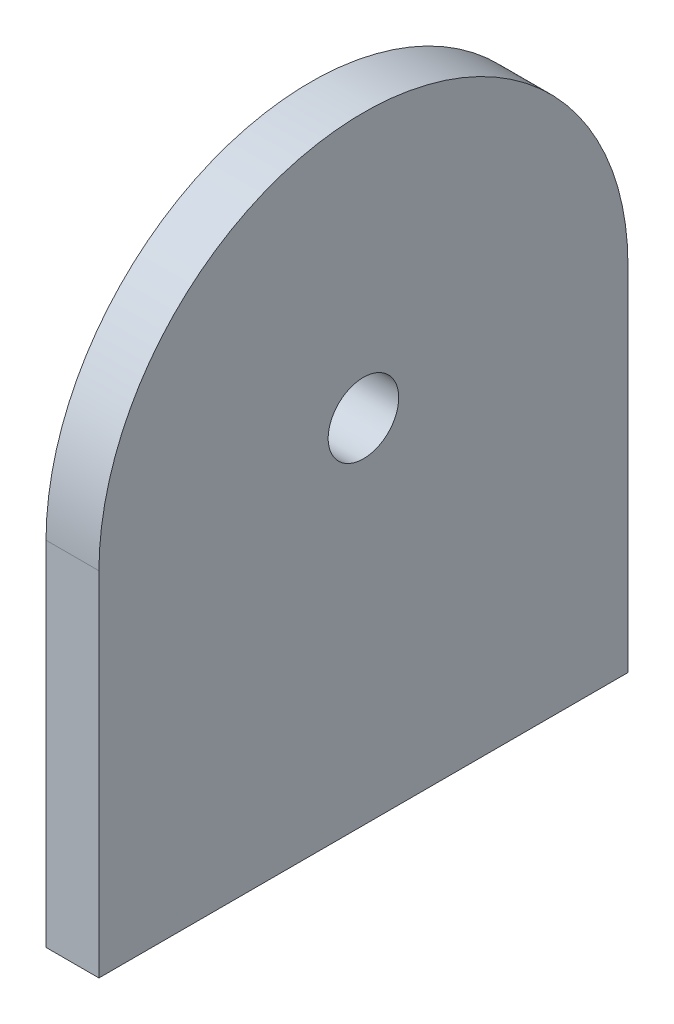
ISO-10303-21;
HEADER;
FILE_DESCRIPTION(('STEP AP214'),'2;1');
FILE_NAME('part.step','',(''),(''),'','','');
FILE_SCHEMA(('AUTOMOTIVE_DESIGN { 1 0 10303 214 1 1 1 1 }'));
ENDSEC;
DATA;
#1=APPLICATION_CONTEXT('core data for automotive mechanical design processes');
#2=APPLICATION_PROTOCOL_DEFINITION('international standard','automotive_design',2000,#1);
#3=PRODUCT_CONTEXT('',#1,'mechanical');
#4=PRODUCT('Part','Part','',(#3));
#5=PRODUCT_RELATED_PRODUCT_CATEGORY('part','',(#4));
#6=PRODUCT_DEFINITION_FORMATION('','',#4);
#7=PRODUCT_DEFINITION_CONTEXT('part definition',#1,'design');
#8=PRODUCT_DEFINITION('design','',#6,#7);
#9=PRODUCT_DEFINITION_SHAPE('','',#8);
#10=(LENGTH_UNIT() NAMED_UNIT(*) SI_UNIT(.MILLI.,.METRE.));
#11=(NAMED_UNIT(*) PLANE_ANGLE_UNIT() SI_UNIT($,.RADIAN.));
#12=(NAMED_UNIT(*) SI_UNIT($,.STERADIAN.) SOLID_ANGLE_UNIT());
#13=UNCERTAINTY_MEASURE_WITH_UNIT(LENGTH_MEASURE(1.E-05),#10,'distance_accuracy_value','');
#14=(GEOMETRIC_REPRESENTATION_CONTEXT(3) GLOBAL_UNCERTAINTY_ASSIGNED_CONTEXT((#13)) GLOBAL_UNIT_ASSIGNED_CONTEXT((#10,
#11,#12)) REPRESENTATION_CONTEXT('',''));
#15=CARTESIAN_POINT('',(0.,0.,0.));
#16=DIRECTION('',(0.,0.,1.));
#17=DIRECTION('',(1.,0.,0.));
#18=AXIS2_PLACEMENT_3D('',#15,#16,#17);
#19=CARTESIAN_POINT('',(3.,20.,15.0000000000001));
#20=DIRECTION('',(1.,0.,0.));
#21=DIRECTION('',(0.,0.,-1.));
#22=AXIS2_PLACEMENT_3D('',#19,#20,#21);
#23=PLANE('',#22);
#24=CARTESIAN_POINT('',(3.,20.,15.0000000000001));
#25=DIRECTION('',(1.,0.,0.));
#26=DIRECTION('',(0.,0.,-1.));
#27=AXIS2_PLACEMENT_3D('',#24,#25,#26);
#28=CIRCLE('',#27,15.);
#29=CARTESIAN_POINT('',(3.,20.,0.));
#30=VERTEX_POINT('',#29);
#31=CARTESIAN_POINT('',(3.,20.,30.0000000000001));
#32=VERTEX_POINT('',#31);
#33=EDGE_CURVE('E85',#30,#32,#28,.T.);
#34=ORIENTED_EDGE('',*,*,#33,.T.);
#35=DIRECTION('',(0.,-1.,0.));
#36=VECTOR('',#35,1.);
#37=CARTESIAN_POINT('',(3.,0.,30.));
#38=LINE('',#37,#36);
#39=CARTESIAN_POINT('',(3.,0.,30.));
#40=VERTEX_POINT('',#39);
#41=EDGE_CURVE('E80',#32,#40,#38,.T.);
#42=ORIENTED_EDGE('',*,*,#41,.T.);
#43=DIRECTION('',(0.,0.,-1.));
#44=VECTOR('',#43,1.);
#45=CARTESIAN_POINT('',(3.,0.,0.));
#46=LINE('',#45,#44);
#47=CARTESIAN_POINT('',(3.,0.,0.));
#48=VERTEX_POINT('',#47);
#49=EDGE_CURVE('E83',#40,#48,#46,.T.);
#50=ORIENTED_EDGE('',*,*,#49,.T.);
#51=DIRECTION('',(0.,1.,0.));
#52=VECTOR('',#51,1.);
#53=CARTESIAN_POINT('',(3.,20.,0.));
#54=LINE('',#53,#52);
#55=EDGE_CURVE('E50',#48,#30,#54,.T.);
#56=ORIENTED_EDGE('',*,*,#55,.T.);
#57=EDGE_LOOP('',(#34,#42,#50,#56));
#58=FACE_BOUND('',#57,.T.);
#59=CARTESIAN_POINT('',(3.,20.,15.0000000000001));
#60=DIRECTION('',(1.,0.,0.));
#61=DIRECTION('',(0.,0.,-1.));
#62=AXIS2_PLACEMENT_3D('',#59,#60,#61);
#63=CIRCLE('',#62,2.);
#64=CARTESIAN_POINT('',(3.,20.,13.0000000000001));
#65=VERTEX_POINT('',#64);
#66=EDGE_CURVE('E100',#65,#65,#63,.T.);
#67=ORIENTED_EDGE('',*,*,#66,.F.);
#68=EDGE_LOOP('',(#67));
#69=FACE_BOUND('',#68,.T.);
#70=ADVANCED_FACE('F33',(#58,#69),#23,.T.);
#71=CARTESIAN_POINT('',(0.,20.,15.0000000000001));
#72=DIRECTION('',(1.,0.,0.));
#73=DIRECTION('',(0.,0.,-1.));
#74=AXIS2_PLACEMENT_3D('',#71,#72,#73);
#75=PLANE('',#74);
#76=CARTESIAN_POINT('',(0.,20.,15.0000000000001));
#77=DIRECTION('',(1.,0.,0.));
#78=DIRECTION('',(0.,0.,-1.));
#79=AXIS2_PLACEMENT_3D('',#76,#77,#78);
#80=CIRCLE('',#79,15.);
#81=CARTESIAN_POINT('',(0.,20.,0.));
#82=VERTEX_POINT('',#81);
#83=CARTESIAN_POINT('',(0.,20.,30.0000000000001));
#84=VERTEX_POINT('',#83);
#85=EDGE_CURVE('E97',#82,#84,#80,.T.);
#86=ORIENTED_EDGE('',*,*,#85,.F.);
#87=DIRECTION('',(0.,1.,0.));
#88=VECTOR('',#87,1.);
#89=CARTESIAN_POINT('',(0.,20.,0.));
#90=LINE('',#89,#88);
#91=CARTESIAN_POINT('',(0.,0.,0.));
#92=VERTEX_POINT('',#91);
#93=EDGE_CURVE('E73',#92,#82,#90,.T.);
#94=ORIENTED_EDGE('',*,*,#93,.F.);
#95=DIRECTION('',(0.,0.,-1.));
#96=VECTOR('',#95,1.);
#97=CARTESIAN_POINT('',(0.,0.,0.));
#98=LINE('',#97,#96);
#99=CARTESIAN_POINT('',(0.,0.,30.));
#100=VERTEX_POINT('',#99);
#101=EDGE_CURVE('E67',#100,#92,#98,.T.);
#102=ORIENTED_EDGE('',*,*,#101,.F.);
#103=DIRECTION('',(0.,-1.,0.));
#104=VECTOR('',#103,1.);
#105=CARTESIAN_POINT('',(0.,0.,30.));
#106=LINE('',#105,#104);
#107=EDGE_CURVE('E89',#84,#100,#106,.T.);
#108=ORIENTED_EDGE('',*,*,#107,.F.);
#109=EDGE_LOOP('',(#86,#94,#102,#108));
#110=FACE_BOUND('',#109,.T.);
#111=CARTESIAN_POINT('',(0.,20.,15.0000000000001));
#112=DIRECTION('',(1.,0.,0.));
#113=DIRECTION('',(0.,0.,-1.));
#114=AXIS2_PLACEMENT_3D('',#111,#112,#113);
#115=CIRCLE('',#114,2.);
#116=CARTESIAN_POINT('',(0.,20.,13.0000000000001));
#117=VERTEX_POINT('',#116);
#118=EDGE_CURVE('E112',#117,#117,#115,.T.);
#119=ORIENTED_EDGE('',*,*,#118,.T.);
#120=EDGE_LOOP('',(#119));
#121=FACE_BOUND('',#120,.T.);
#122=ADVANCED_FACE('F108',(#110,#121),#75,.F.);
#123=CARTESIAN_POINT('',(3.,20.,15.0000000000001));
#124=DIRECTION('',(-1.,0.,0.));
#125=DIRECTION('',(0.,0.,1.));
#126=AXIS2_PLACEMENT_3D('',#123,#124,#125);
#127=CYLINDRICAL_SURFACE('',#126,15.);
#128=ORIENTED_EDGE('',*,*,#85,.T.);
#129=DIRECTION('',(-1.,0.,0.));
#130=VECTOR('',#129,1.);
#131=CARTESIAN_POINT('',(3.,20.,30.0000000000001));
#132=LINE('',#131,#130);
#133=EDGE_CURVE('E11',#32,#84,#132,.T.);
#134=ORIENTED_EDGE('',*,*,#133,.F.);
#135=ORIENTED_EDGE('',*,*,#33,.F.);
#136=DIRECTION('',(-1.,0.,0.));
#137=VECTOR('',#136,1.);
#138=CARTESIAN_POINT('',(3.,20.,0.));
#139=LINE('',#138,#137);
#140=EDGE_CURVE('E93',#30,#82,#139,.T.);
#141=ORIENTED_EDGE('',*,*,#140,.T.);
#142=EDGE_LOOP('',(#128,#134,#135,#141));
#143=FACE_BOUND('',#142,.T.);
#144=ADVANCED_FACE('F35',(#143),#127,.T.);
#145=CARTESIAN_POINT('',(3.,0.,30.));
#146=DIRECTION('',(0.,0.,-1.));
#147=DIRECTION('',(0.,1.,0.));
#148=AXIS2_PLACEMENT_3D('',#145,#146,#147);
#149=PLANE('',#148);
#150=ORIENTED_EDGE('',*,*,#107,.T.);
#151=DIRECTION('',(-1.,0.,0.));
#152=VECTOR('',#151,1.);
#153=CARTESIAN_POINT('',(3.,0.,30.));
#154=LINE('',#153,#152);
#155=EDGE_CURVE('E42',#40,#100,#154,.T.);
#156=ORIENTED_EDGE('',*,*,#155,.F.);
#157=ORIENTED_EDGE('',*,*,#41,.F.);
#158=ORIENTED_EDGE('',*,*,#133,.T.);
#159=EDGE_LOOP('',(#150,#156,#157,#158));
#160=FACE_BOUND('',#159,.T.);
#161=ADVANCED_FACE('F88',(#160),#149,.F.);
#162=CARTESIAN_POINT('',(3.,0.,0.));
#163=DIRECTION('',(0.,1.,0.));
#164=DIRECTION('',(0.,0.,1.));
#165=AXIS2_PLACEMENT_3D('',#162,#163,#164);
#166=PLANE('',#165);
#167=ORIENTED_EDGE('',*,*,#101,.T.);
#168=DIRECTION('',(-1.,0.,0.));
#169=VECTOR('',#168,1.);
#170=CARTESIAN_POINT('',(3.,0.,0.));
#171=LINE('',#170,#169);
#172=EDGE_CURVE('E90',#48,#92,#171,.T.);
#173=ORIENTED_EDGE('',*,*,#172,.F.);
#174=ORIENTED_EDGE('',*,*,#49,.F.);
#175=ORIENTED_EDGE('',*,*,#155,.T.);
#176=EDGE_LOOP('',(#167,#173,#174,#175));
#177=FACE_BOUND('',#176,.T.);
#178=ADVANCED_FACE('F91',(#177),#166,.F.);
#179=CARTESIAN_POINT('',(3.,20.,0.));
#180=DIRECTION('',(0.,0.,1.));
#181=DIRECTION('',(0.,-1.,0.));
#182=AXIS2_PLACEMENT_3D('',#179,#180,#181);
#183=PLANE('',#182);
#184=ORIENTED_EDGE('',*,*,#93,.T.);
#185=ORIENTED_EDGE('',*,*,#140,.F.);
#186=ORIENTED_EDGE('',*,*,#55,.F.);
#187=ORIENTED_EDGE('',*,*,#172,.T.);
#188=EDGE_LOOP('',(#184,#185,#186,#187));
#189=FACE_BOUND('',#188,.T.);
#190=ADVANCED_FACE('F105',(#189),#183,.F.);
#191=CARTESIAN_POINT('',(3.,20.,15.0000000000001));
#192=DIRECTION('',(-1.,0.,0.));
#193=DIRECTION('',(0.,0.,1.));
#194=AXIS2_PLACEMENT_3D('',#191,#192,#193);
#195=CYLINDRICAL_SURFACE('',#194,2.);
#196=ORIENTED_EDGE('',*,*,#66,.T.);
#197=EDGE_LOOP('',(#196));
#198=FACE_BOUND('',#197,.T.);
#199=ORIENTED_EDGE('',*,*,#118,.F.);
#200=EDGE_LOOP('',(#199));
#201=FACE_BOUND('',#200,.T.);
#202=ADVANCED_FACE('F118',(#198,#201),#195,.F.);
#203=CLOSED_SHELL('',(#70,#122,#144,#161,#178,#190,#202));
#204=MANIFOLD_SOLID_BREP('B2',#203);
#205=ADVANCED_BREP_SHAPE_REPRESENTATION('',(#18,#204),#14);
#206=SHAPE_DEFINITION_REPRESENTATION(#9,#205);
ENDSEC;
END-ISO-10303-21;
